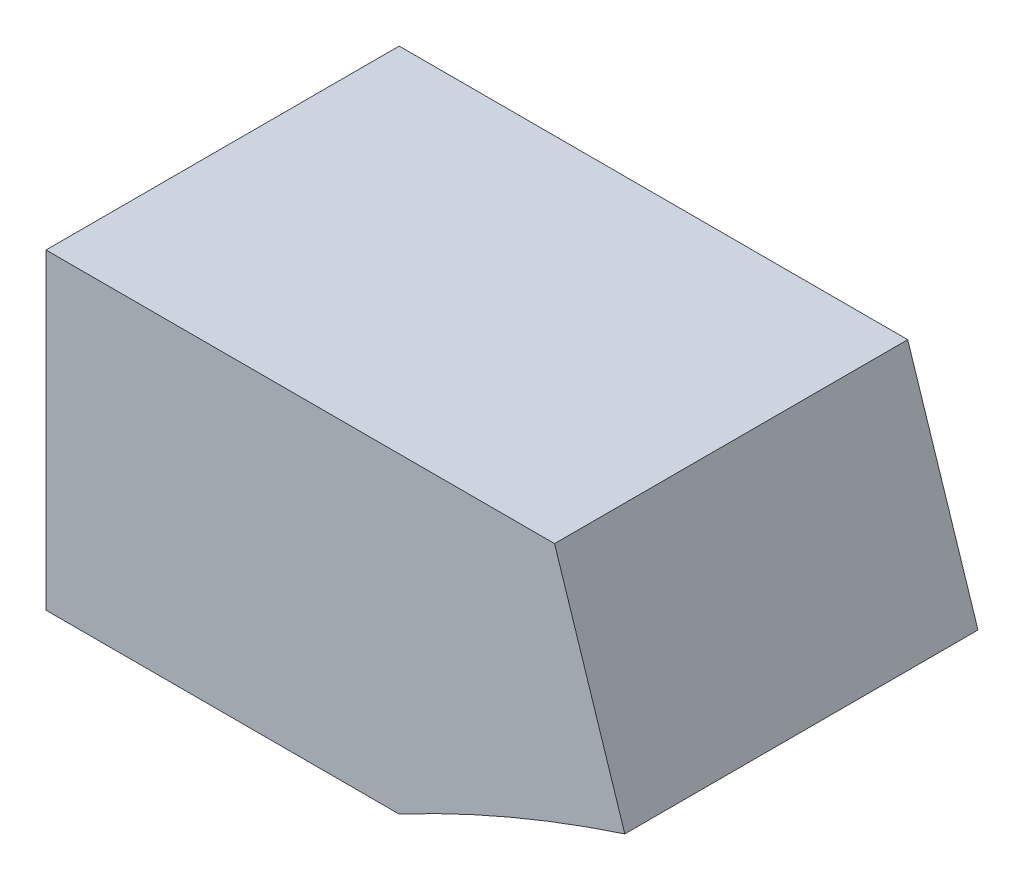
ISO-10303-21;
HEADER;
FILE_DESCRIPTION(('STEP AP214'),'2;1');
FILE_NAME('part.step','',(''),(''),'','','');
FILE_SCHEMA(('AUTOMOTIVE_DESIGN { 1 0 10303 214 1 1 1 1 }'));
ENDSEC;
DATA;
#1=APPLICATION_CONTEXT('core data for automotive mechanical design processes');
#2=APPLICATION_PROTOCOL_DEFINITION('international standard','automotive_design',2000,#1);
#3=PRODUCT_CONTEXT('',#1,'mechanical');
#4=PRODUCT('Part','Part','',(#3));
#5=PRODUCT_RELATED_PRODUCT_CATEGORY('part','',(#4));
#6=PRODUCT_DEFINITION_FORMATION('','',#4);
#7=PRODUCT_DEFINITION_CONTEXT('part definition',#1,'design');
#8=PRODUCT_DEFINITION('design','',#6,#7);
#9=PRODUCT_DEFINITION_SHAPE('','',#8);
#10=(LENGTH_UNIT() NAMED_UNIT(*) SI_UNIT(.MILLI.,.METRE.));
#11=(NAMED_UNIT(*) PLANE_ANGLE_UNIT() SI_UNIT($,.RADIAN.));
#12=(NAMED_UNIT(*) SI_UNIT($,.STERADIAN.) SOLID_ANGLE_UNIT());
#13=UNCERTAINTY_MEASURE_WITH_UNIT(LENGTH_MEASURE(1.E-05),#10,'distance_accuracy_value','');
#14=(GEOMETRIC_REPRESENTATION_CONTEXT(3) GLOBAL_UNCERTAINTY_ASSIGNED_CONTEXT((#13)) GLOBAL_UNIT_ASSIGNED_CONTEXT((#10,
#11,#12)) REPRESENTATION_CONTEXT('',''));
#15=CARTESIAN_POINT('',(0.,0.,0.));
#16=DIRECTION('',(0.,0.,1.));
#17=DIRECTION('',(1.,0.,0.));
#18=AXIS2_PLACEMENT_3D('',#15,#16,#17);
#19=CARTESIAN_POINT('',(-8112.,4992.,624.));
#20=DIRECTION('',(0.,0.,-1.));
#21=DIRECTION('',(-1.,0.,0.));
#22=AXIS2_PLACEMENT_3D('',#19,#20,#21);
#23=CYLINDRICAL_SURFACE('',#22,2496.);
#24=CARTESIAN_POINT('',(-8112.,4992.,0.));
#25=DIRECTION('',(0.,0.,1.));
#26=DIRECTION('',(1.,0.,0.));
#27=AXIS2_PLACEMENT_3D('',#24,#25,#26);
#28=CIRCLE('',#27,2496.);
#29=CARTESIAN_POINT('',(-8883.30641795986,7365.83706467271,0.));
#30=VERTEX_POINT('',#29);
#31=CARTESIAN_POINT('',(-9281.98844438738,7196.8,0.));
#32=VERTEX_POINT('',#31);
#33=EDGE_CURVE('E110',#30,#32,#28,.T.);
#34=ORIENTED_EDGE('',*,*,#33,.F.);
#35=DIRECTION('',(0.,0.,-1.));
#36=VECTOR('',#35,1.);
#37=CARTESIAN_POINT('',(-8883.30641795986,7365.83706467271,624.));
#38=LINE('',#37,#36);
#39=CARTESIAN_POINT('',(-8883.30641795986,7365.83706467271,624.));
#40=VERTEX_POINT('',#39);
#41=EDGE_CURVE('E11',#40,#30,#38,.T.);
#42=ORIENTED_EDGE('',*,*,#41,.F.);
#43=CARTESIAN_POINT('',(-8112.,4992.,624.));
#44=DIRECTION('',(0.,0.,1.));
#45=DIRECTION('',(1.,0.,0.));
#46=AXIS2_PLACEMENT_3D('',#43,#44,#45);
#47=CIRCLE('',#46,2496.);
#48=CARTESIAN_POINT('',(-9281.98844438738,7196.8,624.));
#49=VERTEX_POINT('',#48);
#50=EDGE_CURVE('E121',#40,#49,#47,.T.);
#51=ORIENTED_EDGE('',*,*,#50,.T.);
#52=DIRECTION('',(0.,0.,-1.));
#53=VECTOR('',#52,1.);
#54=CARTESIAN_POINT('',(-9281.98844438738,7196.8,624.));
#55=LINE('',#54,#53);
#56=EDGE_CURVE('E78',#49,#32,#55,.T.);
#57=ORIENTED_EDGE('',*,*,#56,.T.);
#58=EDGE_LOOP('',(#34,#42,#51,#57));
#59=FACE_BOUND('',#58,.T.);
#60=ADVANCED_FACE('F37',(#59),#23,.F.);
#61=CARTESIAN_POINT('',(-5870.26093946249,-1907.36340125821,624.));
#62=DIRECTION('',(-0.951056516295146,-0.309016994374971,0.));
#63=DIRECTION('',(0.309016994374971,-0.951056516295146,0.));
#64=AXIS2_PLACEMENT_3D('',#61,#62,#63);
#65=PLANE('',#64);
#66=DIRECTION('',(-0.309016994374971,0.951056516295146,0.));
#67=VECTOR('',#66,1.);
#68=CARTESIAN_POINT('',(-5870.26093946249,-1907.36340125821,0.));
#69=LINE('',#68,#67);
#70=CARTESIAN_POINT('',(-9007.47868281789,7748.,0.));
#71=VERTEX_POINT('',#70);
#72=EDGE_CURVE('E113',#30,#71,#69,.T.);
#73=ORIENTED_EDGE('',*,*,#72,.T.);
#74=DIRECTION('',(0.,0.,-1.));
#75=VECTOR('',#74,1.);
#76=CARTESIAN_POINT('',(-9007.47868281789,7748.,624.));
#77=LINE('',#76,#75);
#78=CARTESIAN_POINT('',(-9007.47868281789,7748.,624.));
#79=VERTEX_POINT('',#78);
#80=EDGE_CURVE('E45',#79,#71,#77,.T.);
#81=ORIENTED_EDGE('',*,*,#80,.F.);
#82=DIRECTION('',(-0.309016994374971,0.951056516295146,0.));
#83=VECTOR('',#82,1.);
#84=CARTESIAN_POINT('',(-5870.26093946249,-1907.36340125821,624.));
#85=LINE('',#84,#83);
#86=EDGE_CURVE('E102',#40,#79,#85,.T.);
#87=ORIENTED_EDGE('',*,*,#86,.F.);
#88=ORIENTED_EDGE('',*,*,#41,.T.);
#89=EDGE_LOOP('',(#73,#81,#87,#88));
#90=FACE_BOUND('',#89,.T.);
#91=ADVANCED_FACE('F125',(#90),#65,.F.);
#92=CARTESIAN_POINT('',(0.,7748.,624.));
#93=DIRECTION('',(0.,1.,0.));
#94=DIRECTION('',(0.,0.,1.));
#95=AXIS2_PLACEMENT_3D('',#92,#93,#94);
#96=PLANE('',#95);
#97=DIRECTION('',(1.,0.,0.));
#98=VECTOR('',#97,1.);
#99=CARTESIAN_POINT('',(0.,7748.,0.));
#100=LINE('',#99,#98);
#101=CARTESIAN_POINT('',(-9905.98844438738,7748.,0.));
#102=VERTEX_POINT('',#101);
#103=EDGE_CURVE('E94',#102,#71,#100,.T.);
#104=ORIENTED_EDGE('',*,*,#103,.F.);
#105=DIRECTION('',(0.,0.,-1.));
#106=VECTOR('',#105,1.);
#107=CARTESIAN_POINT('',(-9905.98844438738,7748.,624.));
#108=LINE('',#107,#106);
#109=CARTESIAN_POINT('',(-9905.98844438738,7748.,624.));
#110=VERTEX_POINT('',#109);
#111=EDGE_CURVE('E89',#110,#102,#108,.T.);
#112=ORIENTED_EDGE('',*,*,#111,.F.);
#113=DIRECTION('',(1.,0.,0.));
#114=VECTOR('',#113,1.);
#115=CARTESIAN_POINT('',(0.,7748.,624.));
#116=LINE('',#115,#114);
#117=EDGE_CURVE('E92',#110,#79,#116,.T.);
#118=ORIENTED_EDGE('',*,*,#117,.T.);
#119=ORIENTED_EDGE('',*,*,#80,.T.);
#120=EDGE_LOOP('',(#104,#112,#118,#119));
#121=FACE_BOUND('',#120,.T.);
#122=ADVANCED_FACE('F91',(#121),#96,.T.);
#123=CARTESIAN_POINT('',(-9905.98844438738,0.,624.));
#124=DIRECTION('',(-1.,0.,0.));
#125=DIRECTION('',(0.,0.,1.));
#126=AXIS2_PLACEMENT_3D('',#123,#124,#125);
#127=PLANE('',#126);
#128=DIRECTION('',(0.,1.,0.));
#129=VECTOR('',#128,1.);
#130=CARTESIAN_POINT('',(-9905.98844438738,0.,0.));
#131=LINE('',#130,#129);
#132=CARTESIAN_POINT('',(-9905.98844438738,7196.8,0.));
#133=VERTEX_POINT('',#132);
#134=EDGE_CURVE('E117',#133,#102,#131,.T.);
#135=ORIENTED_EDGE('',*,*,#134,.F.);
#136=DIRECTION('',(0.,0.,-1.));
#137=VECTOR('',#136,1.);
#138=CARTESIAN_POINT('',(-9905.98844438738,7196.8,624.));
#139=LINE('',#138,#137);
#140=CARTESIAN_POINT('',(-9905.98844438738,7196.8,624.));
#141=VERTEX_POINT('',#140);
#142=EDGE_CURVE('E71',#141,#133,#139,.T.);
#143=ORIENTED_EDGE('',*,*,#142,.F.);
#144=DIRECTION('',(0.,1.,0.));
#145=VECTOR('',#144,1.);
#146=CARTESIAN_POINT('',(-9905.98844438738,0.,624.));
#147=LINE('',#146,#145);
#148=EDGE_CURVE('E101',#141,#110,#147,.T.);
#149=ORIENTED_EDGE('',*,*,#148,.T.);
#150=ORIENTED_EDGE('',*,*,#111,.T.);
#151=EDGE_LOOP('',(#135,#143,#149,#150));
#152=FACE_BOUND('',#151,.T.);
#153=ADVANCED_FACE('F105',(#152),#127,.T.);
#154=CARTESIAN_POINT('',(0.,7196.8,624.));
#155=DIRECTION('',(0.,1.,0.));
#156=DIRECTION('',(0.,0.,1.));
#157=AXIS2_PLACEMENT_3D('',#154,#155,#156);
#158=PLANE('',#157);
#159=DIRECTION('',(1.,0.,0.));
#160=VECTOR('',#159,1.);
#161=CARTESIAN_POINT('',(0.,7196.8,0.));
#162=LINE('',#161,#160);
#163=EDGE_CURVE('E119',#133,#32,#162,.T.);
#164=ORIENTED_EDGE('',*,*,#163,.T.);
#165=ORIENTED_EDGE('',*,*,#56,.F.);
#166=DIRECTION('',(1.,0.,0.));
#167=VECTOR('',#166,1.);
#168=CARTESIAN_POINT('',(0.,7196.8,624.));
#169=LINE('',#168,#167);
#170=EDGE_CURVE('E53',#141,#49,#169,.T.);
#171=ORIENTED_EDGE('',*,*,#170,.F.);
#172=ORIENTED_EDGE('',*,*,#142,.T.);
#173=EDGE_LOOP('',(#164,#165,#171,#172));
#174=FACE_BOUND('',#173,.T.);
#175=ADVANCED_FACE('F128',(#174),#158,.F.);
#176=CARTESIAN_POINT('',(0.,0.,624.));
#177=DIRECTION('',(0.,0.,1.));
#178=DIRECTION('',(1.,0.,0.));
#179=AXIS2_PLACEMENT_3D('',#176,#177,#178);
#180=PLANE('',#179);
#181=ORIENTED_EDGE('',*,*,#50,.F.);
#182=ORIENTED_EDGE('',*,*,#86,.T.);
#183=ORIENTED_EDGE('',*,*,#117,.F.);
#184=ORIENTED_EDGE('',*,*,#148,.F.);
#185=ORIENTED_EDGE('',*,*,#170,.T.);
#186=EDGE_LOOP('',(#181,#182,#183,#184,#185));
#187=FACE_BOUND('',#186,.T.);
#188=ADVANCED_FACE('F100',(#187),#180,.T.);
#189=CARTESIAN_POINT('',(0.,0.,0.));
#190=DIRECTION('',(0.,0.,1.));
#191=DIRECTION('',(1.,0.,0.));
#192=AXIS2_PLACEMENT_3D('',#189,#190,#191);
#193=PLANE('',#192);
#194=ORIENTED_EDGE('',*,*,#33,.T.);
#195=ORIENTED_EDGE('',*,*,#163,.F.);
#196=ORIENTED_EDGE('',*,*,#134,.T.);
#197=ORIENTED_EDGE('',*,*,#103,.T.);
#198=ORIENTED_EDGE('',*,*,#72,.F.);
#199=EDGE_LOOP('',(#194,#195,#196,#197,#198));
#200=FACE_BOUND('',#199,.T.);
#201=ADVANCED_FACE('F127',(#200),#193,.F.);
#202=CLOSED_SHELL('',(#60,#91,#122,#153,#175,#188,#201));
#203=MANIFOLD_SOLID_BREP('B2',#202);
#204=ADVANCED_BREP_SHAPE_REPRESENTATION('',(#18,#203),#14);
#205=SHAPE_DEFINITION_REPRESENTATION(#9,#204);
ENDSEC;
END-ISO-10303-21;
